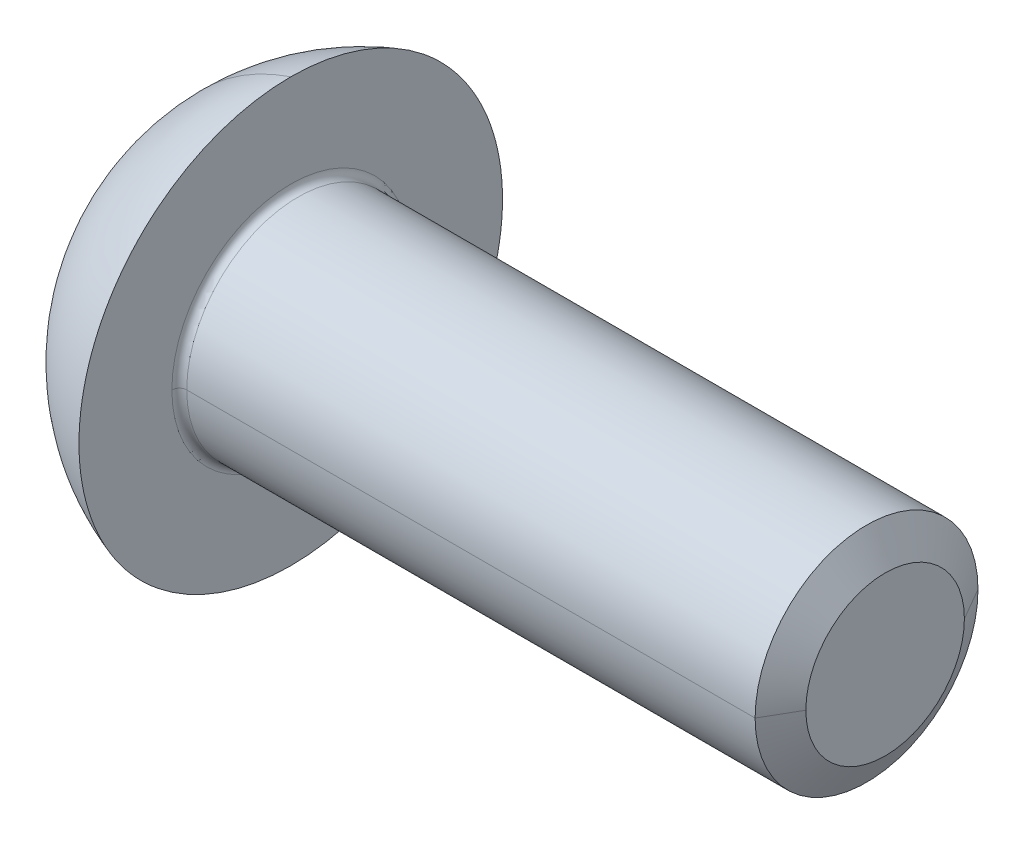
ISO-10303-21;
HEADER;
FILE_DESCRIPTION(('STEP AP214'),'2;1');
FILE_NAME('part.step','',(''),(''),'','','');
FILE_SCHEMA(('AUTOMOTIVE_DESIGN { 1 0 10303 214 1 1 1 1 }'));
ENDSEC;
DATA;
#1=APPLICATION_CONTEXT('core data for automotive mechanical design processes');
#2=APPLICATION_PROTOCOL_DEFINITION('international standard','automotive_design',2000,#1);
#3=PRODUCT_CONTEXT('',#1,'mechanical');
#4=PRODUCT('Part','Part','',(#3));
#5=PRODUCT_RELATED_PRODUCT_CATEGORY('part','',(#4));
#6=PRODUCT_DEFINITION_FORMATION('','',#4);
#7=PRODUCT_DEFINITION_CONTEXT('part definition',#1,'design');
#8=PRODUCT_DEFINITION('design','',#6,#7);
#9=PRODUCT_DEFINITION_SHAPE('','',#8);
#10=(LENGTH_UNIT() NAMED_UNIT(*) SI_UNIT(.MILLI.,.METRE.));
#11=(NAMED_UNIT(*) PLANE_ANGLE_UNIT() SI_UNIT($,.RADIAN.));
#12=(NAMED_UNIT(*) SI_UNIT($,.STERADIAN.) SOLID_ANGLE_UNIT());
#13=UNCERTAINTY_MEASURE_WITH_UNIT(LENGTH_MEASURE(1.E-05),#10,'distance_accuracy_value','');
#14=(GEOMETRIC_REPRESENTATION_CONTEXT(3) GLOBAL_UNCERTAINTY_ASSIGNED_CONTEXT((#13)) GLOBAL_UNIT_ASSIGNED_CONTEXT((#10,
#11,#12)) REPRESENTATION_CONTEXT('',''));
#15=CARTESIAN_POINT('',(0.,0.,0.));
#16=DIRECTION('',(0.,0.,1.));
#17=DIRECTION('',(1.,0.,0.));
#18=AXIS2_PLACEMENT_3D('',#15,#16,#17);
#19=CARTESIAN_POINT('',(0.,1.5,0.));
#20=DIRECTION('',(-1.,0.,0.));
#21=DIRECTION('',(0.,0.,1.));
#22=AXIS2_PLACEMENT_3D('',#19,#20,#21);
#23=PLANE('',#22);
#24=CARTESIAN_POINT('',(0.,0.,0.));
#25=DIRECTION('',(-1.,0.,0.));
#26=DIRECTION('',(0.,0.,1.));
#27=AXIS2_PLACEMENT_3D('',#24,#25,#26);
#28=CIRCLE('',#27,1.06698729810778);
#29=CARTESIAN_POINT('',(0.,0.,1.06698729810778));
#30=VERTEX_POINT('',#29);
#31=CARTESIAN_POINT('',(0.,0.,-1.06698729810778));
#32=VERTEX_POINT('',#31);
#33=EDGE_CURVE('E431',#30,#32,#28,.T.);
#34=ORIENTED_EDGE('',*,*,#33,.F.);
#35=CARTESIAN_POINT('',(0.,0.,0.));
#36=DIRECTION('',(-1.,0.,0.));
#37=DIRECTION('',(0.,0.,1.));
#38=AXIS2_PLACEMENT_3D('',#35,#36,#37);
#39=CIRCLE('',#38,1.06698729810778);
#40=EDGE_CURVE('E11',#32,#30,#39,.T.);
#41=ORIENTED_EDGE('',*,*,#40,.F.);
#42=EDGE_LOOP('',(#34,#41));
#43=FACE_BOUND('',#42,.T.);
#44=ADVANCED_FACE('F16',(#43),#23,.F.);
#45=CARTESIAN_POINT('',(-0.25,0.,0.));
#46=DIRECTION('',(-1.,0.,0.));
#47=DIRECTION('',(0.,0.,1.));
#48=AXIS2_PLACEMENT_3D('',#45,#46,#47);
#49=CONICAL_SURFACE('',#48,1.5,1.0471975511966);
#50=DIRECTION('',(-0.5,0.,-0.866025403784439));
#51=VECTOR('',#50,1.);
#52=CARTESIAN_POINT('',(-0.25,0.,-1.5));
#53=LINE('',#52,#51);
#54=CARTESIAN_POINT('',(-0.25,0.,-1.5));
#55=VERTEX_POINT('',#54);
#56=EDGE_CURVE('E439',#32,#55,#53,.T.);
#57=ORIENTED_EDGE('',*,*,#56,.F.);
#58=ORIENTED_EDGE('',*,*,#40,.T.);
#59=DIRECTION('',(-0.5,0.,0.866025403784439));
#60=VECTOR('',#59,1.);
#61=CARTESIAN_POINT('',(-0.25,0.,1.5));
#62=LINE('',#61,#60);
#63=CARTESIAN_POINT('',(-0.25,0.,1.5));
#64=VERTEX_POINT('',#63);
#65=EDGE_CURVE('E159',#30,#64,#62,.T.);
#66=ORIENTED_EDGE('',*,*,#65,.T.);
#67=CARTESIAN_POINT('',(-0.25,0.,0.));
#68=DIRECTION('',(-1.,0.,0.));
#69=DIRECTION('',(0.,0.,1.));
#70=AXIS2_PLACEMENT_3D('',#67,#68,#69);
#71=CIRCLE('',#70,1.5);
#72=EDGE_CURVE('E487',#55,#64,#71,.T.);
#73=ORIENTED_EDGE('',*,*,#72,.F.);
#74=EDGE_LOOP('',(#57,#58,#66,#73));
#75=FACE_BOUND('',#74,.T.);
#76=ADVANCED_FACE('F421',(#75),#49,.T.);
#77=CARTESIAN_POINT('',(-8.,0.577350269189628,1.));
#78=DIRECTION('',(0.,0.866025403784439,0.5));
#79=DIRECTION('',(1.,0.,0.));
#80=AXIS2_PLACEMENT_3D('',#77,#78,#79);
#81=PLANE('',#80);
#82=CARTESIAN_POINT('',(-9.65000000000068,1.15470053837921,0.));
#83=CARTESIAN_POINT('',(-9.64376726167592,1.13071986950292,0.0415357368933016));
#84=CARTESIAN_POINT('',(-9.63810980149159,1.10669828377802,0.0831423438471911));
#85=CARTESIAN_POINT('',(-9.62817117559528,1.05857535015065,0.166493709899067));
#86=CARTESIAN_POINT('',(-9.62389053369627,1.03447397540707,0.208238515487194));
#87=CARTESIAN_POINT('',(-9.6169532436391,0.986328910806296,0.291628213509428));
#88=CARTESIAN_POINT('',(-9.614288813427,0.96228550881187,0.333272607350576));
#89=CARTESIAN_POINT('',(-9.61071616129143,0.914169868462047,0.41661134107518));
#90=CARTESIAN_POINT('',(-9.60980762113605,0.890097636123247,0.458305670537585));
#91=CARTESIAN_POINT('',(-9.60980762113606,0.841953171445647,0.541694329462394));
#92=CARTESIAN_POINT('',(-9.61071616129145,0.817880939106848,0.583388658924797));
#93=CARTESIAN_POINT('',(-9.61428881342703,0.769765298757027,0.666727392649398));
#94=CARTESIAN_POINT('',(-9.61695324363914,0.745721896762602,0.708371786490545));
#95=CARTESIAN_POINT('',(-9.6238905336963,0.697576832161825,0.791761484512776));
#96=CARTESIAN_POINT('',(-9.62817117559529,0.673475457418251,0.833506290100903));
#97=CARTESIAN_POINT('',(-9.63810980149154,0.625352523790876,0.916857656152781));
#98=CARTESIAN_POINT('',(-9.64376726167582,0.60133093806598,0.958464263106673));
#99=CARTESIAN_POINT('',(-9.65000000000052,0.577350269189683,0.999999999999905));
#100=B_SPLINE_CURVE_WITH_KNOTS('',3,(#82,#83,#84,#85,#86,#87,#88,#89,#90,#91,#92,#93,#94,#95,
#96,#97,#98,#99),.UNSPECIFIED.,.F.,.F.,(4,2,2,2,2,2,2,2,4),(0.,0.145100985590908,
0.290257109991389,0.4347086423557,0.579133992329352,0.723559342302999,0.868010874667305,
1.01316699906778,1.15826798465868),.UNSPECIFIED.);
#101=CARTESIAN_POINT('',(-9.65000000046937,1.15470053837925,0.));
#102=VERTEX_POINT('',#101);
#103=CARTESIAN_POINT('',(-9.65000000046937,0.577350269189629,1.));
#104=VERTEX_POINT('',#103);
#105=EDGE_CURVE('E291',#102,#104,#100,.T.);
#106=ORIENTED_EDGE('',*,*,#105,.F.);
#107=DIRECTION('',(-1.,0.,0.));
#108=VECTOR('',#107,1.);
#109=CARTESIAN_POINT('',(-8.,1.15470053837925,0.));
#110=LINE('',#109,#108);
#111=CARTESIAN_POINT('',(-8.61,1.15470053837925,0.));
#112=VERTEX_POINT('',#111);
#113=EDGE_CURVE('E132',#112,#102,#110,.T.);
#114=ORIENTED_EDGE('',*,*,#113,.F.);
#115=CARTESIAN_POINT('',(-8.61,0.577350269189628,1.));
#116=CARTESIAN_POINT('',(-8.59669118616951,0.602534842869977,0.956379038818674));
#117=CARTESIAN_POINT('',(-8.58459776882803,0.627901365980377,0.912442931980091));
#118=CARTESIAN_POINT('',(-8.56347623600002,0.678999571015597,0.823938244683518));
#119=CARTESIAN_POINT('',(-8.55445410606408,0.704731865309021,0.779368603571993));
#120=CARTESIAN_POINT('',(-8.5403140378043,0.755930086890535,0.690690682535642));
#121=CARTESIAN_POINT('',(-8.53511923495459,0.78139052146778,0.64659191626507));
#122=CARTESIAN_POINT('',(-8.52879231643342,0.832415969093251,0.558213248498809));
#123=CARTESIAN_POINT('',(-8.52765622218832,0.857980855121199,0.513933567008696));
#124=CARTESIAN_POINT('',(-8.5294362546147,0.906212543236443,0.430393832658278));
#125=CARTESIAN_POINT('',(-8.53191348011681,0.928883762571843,0.391126128899826));
#126=CARTESIAN_POINT('',(-8.53996223171689,0.974103682037768,0.312802930870671));
#127=CARTESIAN_POINT('',(-8.54553612441605,0.996652275126995,0.273747622000933));
#128=CARTESIAN_POINT('',(-8.55954577375543,1.04195475948945,0.195281417376069));
#129=CARTESIAN_POINT('',(-8.56803338874673,1.06470453465151,0.155877650934607));
#130=CARTESIAN_POINT('',(-8.58736571836096,1.10991568547614,0.077569640637688));
#131=CARTESIAN_POINT('',(-8.5982065869898,1.13237746911104,0.0386646901534197));
#132=CARTESIAN_POINT('',(-8.61,1.15470053837925,0.));
#133=B_SPLINE_CURVE_WITH_KNOTS('',3,(#115,#116,#117,#118,#119,#120,#121,#122,#123,#124,#125,
#126,#127,#128,#129,#130,#131,#132),.UNSPECIFIED.,.F.,.F.,(4,2,2,2,2,2,2,2,4),(0.,
0.156341003276327,0.312984974046569,0.466390245349056,0.619645098882076,0.755763510276886,
0.891986092379271,1.03077096081375,1.16933069408602),.UNSPECIFIED.);
#134=CARTESIAN_POINT('',(-8.61,0.577350269189628,1.));
#135=VERTEX_POINT('',#134);
#136=EDGE_CURVE('E235',#135,#112,#133,.T.);
#137=ORIENTED_EDGE('',*,*,#136,.F.);
#138=DIRECTION('',(-1.,0.,0.));
#139=VECTOR('',#138,1.);
#140=CARTESIAN_POINT('',(-8.,0.577350269189628,1.));
#141=LINE('',#140,#139);
#142=EDGE_CURVE('E34',#135,#104,#141,.T.);
#143=ORIENTED_EDGE('',*,*,#142,.T.);
#144=EDGE_LOOP('',(#106,#114,#137,#143));
#145=FACE_BOUND('',#144,.T.);
#146=ADVANCED_FACE('F265',(#145),#81,.F.);
#147=CARTESIAN_POINT('',(-8.,-0.577350269189627,1.));
#148=DIRECTION('',(0.,0.,1.));
#149=DIRECTION('',(1.,0.,0.));
#150=AXIS2_PLACEMENT_3D('',#147,#148,#149);
#151=PLANE('',#150);
#152=CARTESIAN_POINT('',(-9.65000000000068,0.577350269189541,1.));
#153=CARTESIAN_POINT('',(-9.64377973065235,0.529473275543324,1.));
#154=CARTESIAN_POINT('',(-9.63813050190451,0.481515119884375,1.));
#155=CARTESIAN_POINT('',(-9.62821028183204,0.38550945440147,1.));
#156=CARTESIAN_POINT('',(-9.62393782154085,0.337462095195001,1.));
#157=CARTESIAN_POINT('',(-9.61699222106548,0.241237732564266,1.));
#158=CARTESIAN_POINT('',(-9.61431943549371,0.193060702770735,1.));
#159=CARTESIAN_POINT('',(-9.61071685569576,0.0965907516284085,1.));
#160=CARTESIAN_POINT('',(-9.60978892949644,0.0482977614337777,1.));
#161=CARTESIAN_POINT('',(-9.6098076211361,0.,1.));
#162=B_SPLINE_CURVE_WITH_KNOTS('',3,(#152,#153,#154,#155,#156,#157,#158,#159,#160,#161),
.UNSPECIFIED.,.F.,.F.,(4,2,2,2,4),(0.,0.144845042796863,0.289535025028086,0.434257069952768,
0.579133964656165),.UNSPECIFIED.);
#163=CARTESIAN_POINT('',(-9.60980762113568,0.,1.));
#164=VERTEX_POINT('',#163);
#165=EDGE_CURVE('E196',#104,#164,#162,.T.);
#166=ORIENTED_EDGE('',*,*,#165,.F.);
#167=ORIENTED_EDGE('',*,*,#142,.F.);
#168=CARTESIAN_POINT('',(-8.52827549630851,1.4285582721271E-13,1.));
#169=CARTESIAN_POINT('',(-8.52822782798261,0.0488748267229894,1.));
#170=CARTESIAN_POINT('',(-8.53016863705377,0.0977245826684721,1.));
#171=CARTESIAN_POINT('',(-8.53763474391835,0.194944280558686,1.));
#172=CARTESIAN_POINT('',(-8.54314472651941,0.243315380182376,1.));
#173=CARTESIAN_POINT('',(-8.55735616838471,0.339523836155668,1.));
#174=CARTESIAN_POINT('',(-8.56605465786892,0.387361646626337,1.));
#175=CARTESIAN_POINT('',(-8.58614159314306,0.482688461520486,1.));
#176=CARTESIAN_POINT('',(-8.59754141196548,0.530175091125679,1.));
#177=CARTESIAN_POINT('',(-8.61,0.577350269189628,1.));
#178=B_SPLINE_CURVE_WITH_KNOTS('',3,(#168,#169,#170,#171,#172,#173,#174,#175,#176,#177),
.UNSPECIFIED.,.F.,.F.,(4,2,2,2,4),(0.,0.146546606087911,0.292468514667007,0.438254855280999,
0.58466624068123),.UNSPECIFIED.);
#179=CARTESIAN_POINT('',(-8.52827549630851,1.4285582721271E-13,1.));
#180=VERTEX_POINT('',#179);
#181=EDGE_CURVE('E243',#180,#135,#178,.T.);
#182=ORIENTED_EDGE('',*,*,#181,.F.);
#183=CARTESIAN_POINT('',(-8.61,-0.577350269189627,1.));
#184=CARTESIAN_POINT('',(-8.59754141196548,-0.530175091125654,1.));
#185=CARTESIAN_POINT('',(-8.58614159314305,-0.482688461520439,1.));
#186=CARTESIAN_POINT('',(-8.5660546578689,-0.387361646626243,1.));
#187=CARTESIAN_POINT('',(-8.55735616838469,-0.33952383615555,1.));
#188=CARTESIAN_POINT('',(-8.54314472651938,-0.243315380182211,1.));
#189=CARTESIAN_POINT('',(-8.53763474391832,-0.194944280558497,1.));
#190=CARTESIAN_POINT('',(-8.53016863705376,-0.0977245826682346,1.));
#191=CARTESIAN_POINT('',(-8.52822782798261,-0.0488748267227278,1.));
#192=CARTESIAN_POINT('',(-8.52827549630851,1.42752632317457E-13,1.));
#193=B_SPLINE_CURVE_WITH_KNOTS('',3,(#183,#184,#185,#186,#187,#188,#189,#190,#191,#192),
.UNSPECIFIED.,.F.,.F.,(4,2,2,2,4),(0.,0.146411385400302,0.292197726014365,0.438119634593531,
0.584666240681514),.UNSPECIFIED.);
#194=CARTESIAN_POINT('',(-8.61,-0.577350269189627,1.));
#195=VERTEX_POINT('',#194);
#196=EDGE_CURVE('E327',#195,#180,#193,.T.);
#197=ORIENTED_EDGE('',*,*,#196,.F.);
#198=DIRECTION('',(-1.,0.,0.));
#199=VECTOR('',#198,1.);
#200=CARTESIAN_POINT('',(-8.,-0.577350269189627,1.));
#201=LINE('',#200,#199);
#202=CARTESIAN_POINT('',(-9.65000000046937,-0.57735026918963,1.));
#203=VERTEX_POINT('',#202);
#204=EDGE_CURVE('E166',#195,#203,#201,.T.);
#205=ORIENTED_EDGE('',*,*,#204,.T.);
#206=CARTESIAN_POINT('',(-9.60980762113613,0.,1.));
#207=CARTESIAN_POINT('',(-9.60978892949634,-0.0482977614337789,1.));
#208=CARTESIAN_POINT('',(-9.61071685569565,-0.0965907516284106,1.));
#209=CARTESIAN_POINT('',(-9.61431943549365,-0.193060702770737,1.));
#210=CARTESIAN_POINT('',(-9.61699222106547,-0.241237732564265,1.));
#211=CARTESIAN_POINT('',(-9.62393782154089,-0.337462095195,1.));
#212=CARTESIAN_POINT('',(-9.62821028183206,-0.385509454401471,1.));
#213=CARTESIAN_POINT('',(-9.6381305019045,-0.481515119884378,1.));
#214=CARTESIAN_POINT('',(-9.64377973065232,-0.529473275543328,1.));
#215=CARTESIAN_POINT('',(-9.65000000000067,-0.577350269189545,1.));
#216=B_SPLINE_CURVE_WITH_KNOTS('',3,(#206,#207,#208,#209,#210,#211,#212,#213,#214,#215),
.UNSPECIFIED.,.F.,.F.,(4,2,2,2,4),(0.,0.144876894703401,0.289598939628086,0.434288921859311,
0.579133964656175),.UNSPECIFIED.);
#217=EDGE_CURVE('E281',#164,#203,#216,.T.);
#218=ORIENTED_EDGE('',*,*,#217,.F.);
#219=EDGE_LOOP('',(#166,#167,#182,#197,#205,#218));
#220=FACE_BOUND('',#219,.T.);
#221=ADVANCED_FACE('F260',(#220),#151,.F.);
#222=CARTESIAN_POINT('',(-8.,-1.15470053837925,0.));
#223=DIRECTION('',(0.,-0.866025403784439,0.5));
#224=DIRECTION('',(-1.,0.,0.));
#225=AXIS2_PLACEMENT_3D('',#222,#223,#224);
#226=PLANE('',#225);
#227=CARTESIAN_POINT('',(-9.65000000000068,-0.577350269189672,0.999999999999921));
#228=CARTESIAN_POINT('',(-9.64376726167592,-0.601330938065965,0.958464263106695));
#229=CARTESIAN_POINT('',(-9.63810980149159,-0.62535252379086,0.916857656152805));
#230=CARTESIAN_POINT('',(-9.62817117559528,-0.673475457418234,0.833506290100929));
#231=CARTESIAN_POINT('',(-9.62389053369627,-0.697576832161807,0.791761484512803));
#232=CARTESIAN_POINT('',(-9.6169532436391,-0.745721896762585,0.70837178649057));
#233=CARTESIAN_POINT('',(-9.614288813427,-0.769765298757011,0.666727392649422));
#234=CARTESIAN_POINT('',(-9.61071616129143,-0.817880939106833,0.583388658924818));
#235=CARTESIAN_POINT('',(-9.60980762113605,-0.841953171445634,0.541694329462413));
#236=CARTESIAN_POINT('',(-9.60980762113606,-0.890097636123234,0.458305670537605));
#237=CARTESIAN_POINT('',(-9.61071616129145,-0.914169868462033,0.416611341075201));
#238=CARTESIAN_POINT('',(-9.61428881342703,-0.962285508811854,0.333272607350601));
#239=CARTESIAN_POINT('',(-9.61695324363914,-0.986328910806278,0.291628213509455));
#240=CARTESIAN_POINT('',(-9.6238905336963,-1.03447397540706,0.208238515487223));
#241=CARTESIAN_POINT('',(-9.62817117559529,-1.05857535015063,0.166493709899097));
#242=CARTESIAN_POINT('',(-9.63810980149154,-1.106698283778,0.0831423438472185));
#243=CARTESIAN_POINT('',(-9.64376726167582,-1.1307198695029,0.0415357368933265));
#244=CARTESIAN_POINT('',(-9.65000000000052,-1.1547005383792,0.));
#245=B_SPLINE_CURVE_WITH_KNOTS('',3,(#227,#228,#229,#230,#231,#232,#233,#234,#235,#236,#237,
#238,#239,#240,#241,#242,#243,#244),.UNSPECIFIED.,.F.,.F.,(4,2,2,2,2,2,2,2,4),(0.,
0.145100985590907,0.290257109991388,0.434708642355698,0.57913399232935,0.723559342302996,
0.868010874667301,1.01316699906778,1.15826798465868),.UNSPECIFIED.);
#246=CARTESIAN_POINT('',(-9.65000000046937,-1.15470053837925,0.));
#247=VERTEX_POINT('',#246);
#248=EDGE_CURVE('E290',#203,#247,#245,.T.);
#249=ORIENTED_EDGE('',*,*,#248,.F.);
#250=ORIENTED_EDGE('',*,*,#204,.F.);
#251=CARTESIAN_POINT('',(-8.61,-1.15470053837925,0.));
#252=CARTESIAN_POINT('',(-8.59669118616951,-1.1295159646989,0.0436209611813256));
#253=CARTESIAN_POINT('',(-8.58459776882803,-1.1041494415885,0.0875570680199079));
#254=CARTESIAN_POINT('',(-8.56347623600002,-1.05305123655328,0.176061755316481));
#255=CARTESIAN_POINT('',(-8.55445410606407,-1.02731894225986,0.220631396428006));
#256=CARTESIAN_POINT('',(-8.5403140378043,-0.976120720678346,0.309309317464357));
#257=CARTESIAN_POINT('',(-8.53511923495459,-0.950660286101101,0.353408083734928));
#258=CARTESIAN_POINT('',(-8.52879231643342,-0.89963483847563,0.441786751501189));
#259=CARTESIAN_POINT('',(-8.52765622218832,-0.874069952447682,0.486066432991302));
#260=CARTESIAN_POINT('',(-8.52943625461469,-0.825838264332438,0.56960616734172));
#261=CARTESIAN_POINT('',(-8.53191348011681,-0.803167044997038,0.608873871100172));
#262=CARTESIAN_POINT('',(-8.53996223171689,-0.757947125531113,0.687197069129327));
#263=CARTESIAN_POINT('',(-8.54553612441605,-0.735398532441885,0.726252377999065));
#264=CARTESIAN_POINT('',(-8.55954577375543,-0.690096048079432,0.804718582623929));
#265=CARTESIAN_POINT('',(-8.56803338874673,-0.667346272917369,0.844122349065392));
#266=CARTESIAN_POINT('',(-8.58736571836095,-0.622135122092738,0.922430359362311));
#267=CARTESIAN_POINT('',(-8.59820658698979,-0.599673338457837,0.96133530984658));
#268=CARTESIAN_POINT('',(-8.61,-0.577350269189626,1.));
#269=B_SPLINE_CURVE_WITH_KNOTS('',3,(#251,#252,#253,#254,#255,#256,#257,#258,#259,#260,#261,
#262,#263,#264,#265,#266,#267,#268),.UNSPECIFIED.,.F.,.F.,(4,2,2,2,2,2,2,2,4),(0.,
0.156341003276326,0.312984974046568,0.466390245349054,0.619645098882075,0.755763510276885,
0.891986092379271,1.03077096081375,1.16933069408602),.UNSPECIFIED.);
#270=CARTESIAN_POINT('',(-8.61,-1.15470053837925,0.));
#271=VERTEX_POINT('',#270);
#272=EDGE_CURVE('E141',#271,#195,#269,.T.);
#273=ORIENTED_EDGE('',*,*,#272,.F.);
#274=DIRECTION('',(-1.,0.,0.));
#275=VECTOR('',#274,1.);
#276=CARTESIAN_POINT('',(-8.,-1.15470053837925,0.));
#277=LINE('',#276,#275);
#278=EDGE_CURVE('E131',#271,#247,#277,.T.);
#279=ORIENTED_EDGE('',*,*,#278,.T.);
#280=EDGE_LOOP('',(#249,#250,#273,#279));
#281=FACE_BOUND('',#280,.T.);
#282=ADVANCED_FACE('F18',(#281),#226,.F.);
#283=CARTESIAN_POINT('',(-8.,-0.577350269189626,-1.));
#284=DIRECTION('',(0.,-0.866025403784439,-0.5));
#285=DIRECTION('',(0.,0.5,-0.866025403784439));
#286=AXIS2_PLACEMENT_3D('',#283,#284,#285);
#287=PLANE('',#286);
#288=CARTESIAN_POINT('',(-9.65000000000068,-1.15470053837921,0.));
#289=CARTESIAN_POINT('',(-9.64376726167592,-1.13071986950292,-0.0415357368932996));
#290=CARTESIAN_POINT('',(-9.63810980149159,-1.10669828377802,-0.0831423438471893));
#291=CARTESIAN_POINT('',(-9.62817117559528,-1.05857535015065,-0.166493709899066));
#292=CARTESIAN_POINT('',(-9.62389053369627,-1.03447397540707,-0.208238515487192));
#293=CARTESIAN_POINT('',(-9.6169532436391,-0.986328910806295,-0.291628213509426));
#294=CARTESIAN_POINT('',(-9.614288813427,-0.962285508811869,-0.333272607350574));
#295=CARTESIAN_POINT('',(-9.61071616129143,-0.914169868462046,-0.416611341075179));
#296=CARTESIAN_POINT('',(-9.60980762113605,-0.890097636123246,-0.458305670537584));
#297=CARTESIAN_POINT('',(-9.60980762113606,-0.841953171445645,-0.541694329462393));
#298=CARTESIAN_POINT('',(-9.61071616129145,-0.817880939106846,-0.583388658924796));
#299=CARTESIAN_POINT('',(-9.61428881342703,-0.769765298757025,-0.666727392649397));
#300=CARTESIAN_POINT('',(-9.61695324363914,-0.7457218967626,-0.708371786490544));
#301=CARTESIAN_POINT('',(-9.6238905336963,-0.697576832161823,-0.791761484512776));
#302=CARTESIAN_POINT('',(-9.62817117559529,-0.67347545741825,-0.833506290100902));
#303=CARTESIAN_POINT('',(-9.63810980149154,-0.625352523790874,-0.916857656152781));
#304=CARTESIAN_POINT('',(-9.64376726167582,-0.601330938065978,-0.958464263106673));
#305=CARTESIAN_POINT('',(-9.65000000000052,-0.577350269189681,-0.999999999999905));
#306=B_SPLINE_CURVE_WITH_KNOTS('',3,(#288,#289,#290,#291,#292,#293,#294,#295,#296,#297,#298,
#299,#300,#301,#302,#303,#304,#305),.UNSPECIFIED.,.F.,.F.,(4,2,2,2,2,2,2,2,4),(0.,
0.145100985590908,0.29025710999139,0.4347086423557,0.579133992329353,0.723559342303001,
0.868010874667307,1.01316699906778,1.15826798465869),.UNSPECIFIED.);
#307=CARTESIAN_POINT('',(-9.65000000046937,-0.577350269189626,-1.));
#308=VERTEX_POINT('',#307);
#309=EDGE_CURVE('E252',#247,#308,#306,.T.);
#310=ORIENTED_EDGE('',*,*,#309,.F.);
#311=ORIENTED_EDGE('',*,*,#278,.F.);
#312=CARTESIAN_POINT('',(-8.61,-0.577350269189626,-1.));
#313=CARTESIAN_POINT('',(-8.59669118616951,-0.602534842869975,-0.956379038818673));
#314=CARTESIAN_POINT('',(-8.58459776882803,-0.627901365980375,-0.912442931980091));
#315=CARTESIAN_POINT('',(-8.56347623600002,-0.678999571015595,-0.823938244683518));
#316=CARTESIAN_POINT('',(-8.55445410606407,-0.704731865309019,-0.779368603571993));
#317=CARTESIAN_POINT('',(-8.5403140378043,-0.755930086890532,-0.690690682535642));
#318=CARTESIAN_POINT('',(-8.53511923495459,-0.781390521467777,-0.646591916265071));
#319=CARTESIAN_POINT('',(-8.52879231643342,-0.832415969093248,-0.55821324849881));
#320=CARTESIAN_POINT('',(-8.52765622218832,-0.857980855121196,-0.513933567008697));
#321=CARTESIAN_POINT('',(-8.52943625461469,-0.90621254323644,-0.430393832658279));
#322=CARTESIAN_POINT('',(-8.53191348011681,-0.92888376257184,-0.391126128899827));
#323=CARTESIAN_POINT('',(-8.53996223171689,-0.974103682037765,-0.312802930870672));
#324=CARTESIAN_POINT('',(-8.54553612441605,-0.996652275126992,-0.273747622000934));
#325=CARTESIAN_POINT('',(-8.55954577375543,-1.04195475948945,-0.19528141737607));
#326=CARTESIAN_POINT('',(-8.56803338874673,-1.06470453465151,-0.155877650934608));
#327=CARTESIAN_POINT('',(-8.58736571836095,-1.10991568547614,-0.0775696406376888));
#328=CARTESIAN_POINT('',(-8.59820658698979,-1.13237746911104,-0.0386646901534204));
#329=CARTESIAN_POINT('',(-8.61,-1.15470053837925,0.));
#330=B_SPLINE_CURVE_WITH_KNOTS('',3,(#312,#313,#314,#315,#316,#317,#318,#319,#320,#321,#322,
#323,#324,#325,#326,#327,#328,#329),.UNSPECIFIED.,.F.,.F.,(4,2,2,2,2,2,2,2,4),(0.,
0.156341003276326,0.312984974046568,0.466390245349054,0.619645098882075,0.755763510276884,
0.89198609237927,1.03077096081375,1.16933069408602),.UNSPECIFIED.);
#331=CARTESIAN_POINT('',(-8.61,-0.577350269189626,-1.));
#332=VERTEX_POINT('',#331);
#333=EDGE_CURVE('E135',#332,#271,#330,.T.);
#334=ORIENTED_EDGE('',*,*,#333,.F.);
#335=DIRECTION('',(-1.,0.,0.));
#336=VECTOR('',#335,1.);
#337=CARTESIAN_POINT('',(-8.,-0.577350269189626,-1.));
#338=LINE('',#337,#336);
#339=EDGE_CURVE('E119',#332,#308,#338,.T.);
#340=ORIENTED_EDGE('',*,*,#339,.T.);
#341=EDGE_LOOP('',(#310,#311,#334,#340));
#342=FACE_BOUND('',#341,.T.);
#343=ADVANCED_FACE('F136',(#342),#287,.F.);
#344=CARTESIAN_POINT('',(-8.,0.577350269189628,-1.));
#345=DIRECTION('',(0.,0.,-1.));
#346=DIRECTION('',(0.,-1.,0.));
#347=AXIS2_PLACEMENT_3D('',#344,#345,#346);
#348=PLANE('',#347);
#349=CARTESIAN_POINT('',(-9.65000000000068,-0.577350269189539,-1.));
#350=CARTESIAN_POINT('',(-9.64376726167592,-0.529388931436952,-1.));
#351=CARTESIAN_POINT('',(-9.63810980149159,-0.481345759987161,-1.));
#352=CARTESIAN_POINT('',(-9.62817117559528,-0.385099892732414,-1.));
#353=CARTESIAN_POINT('',(-9.62389053369627,-0.336897143245266,-1.));
#354=CARTESIAN_POINT('',(-9.6169532436391,-0.24060701404371,-1.));
#355=CARTESIAN_POINT('',(-9.614288813427,-0.192520210054858,-1.));
#356=CARTESIAN_POINT('',(-9.61071616129143,-0.0962889293552123,-1.));
#357=CARTESIAN_POINT('',(-9.60980762113605,-0.0481444646776111,-1.));
#358=CARTESIAN_POINT('',(-9.60980762113606,0.0481444646775891,-1.));
#359=CARTESIAN_POINT('',(-9.61071616129145,0.0962889293551882,-1.));
#360=CARTESIAN_POINT('',(-9.61428881342703,0.19252021005483,-1.));
#361=CARTESIAN_POINT('',(-9.61695324363914,0.24060701404368,-1.));
#362=CARTESIAN_POINT('',(-9.6238905336963,0.336897143245234,-1.));
#363=CARTESIAN_POINT('',(-9.62817117559529,0.385099892732381,-1.));
#364=CARTESIAN_POINT('',(-9.63810980149154,0.481345759987132,-1.));
#365=CARTESIAN_POINT('',(-9.64376726167582,0.529388931436925,-1.));
#366=CARTESIAN_POINT('',(-9.65000000000052,0.577350269189519,-1.));
#367=B_SPLINE_CURVE_WITH_KNOTS('',3,(#349,#350,#351,#352,#353,#354,#355,#356,#357,#358,#359,
#360,#361,#362,#363,#364,#365,#366),.UNSPECIFIED.,.F.,.F.,(4,2,2,2,2,2,2,2,4),(0.,
0.145100985590908,0.29025710999139,0.434708642355701,0.579133992329354,0.723559342303001,
0.868010874667307,1.01316699906779,1.15826798465869),.UNSPECIFIED.);
#368=CARTESIAN_POINT('',(-9.65000000046937,0.577350269189629,-1.));
#369=VERTEX_POINT('',#368);
#370=EDGE_CURVE('E125',#308,#369,#367,.T.);
#371=ORIENTED_EDGE('',*,*,#370,.F.);
#372=ORIENTED_EDGE('',*,*,#339,.F.);
#373=CARTESIAN_POINT('',(-8.52827549630851,1.42978290888809E-13,-1.));
#374=CARTESIAN_POINT('',(-8.52822782798261,-0.0488748267227276,-1.));
#375=CARTESIAN_POINT('',(-8.53016863705376,-0.0977245826682343,-1.));
#376=CARTESIAN_POINT('',(-8.53763474391832,-0.194944280558496,-1.));
#377=CARTESIAN_POINT('',(-8.54314472651938,-0.24331538018221,-1.));
#378=CARTESIAN_POINT('',(-8.55735616838469,-0.339523836155549,-1.));
#379=CARTESIAN_POINT('',(-8.5660546578689,-0.387361646626242,-1.));
#380=CARTESIAN_POINT('',(-8.58614159314305,-0.482688461520438,-1.));
#381=CARTESIAN_POINT('',(-8.59754141196548,-0.530175091125654,-1.));
#382=CARTESIAN_POINT('',(-8.61,-0.577350269189626,-1.));
#383=B_SPLINE_CURVE_WITH_KNOTS('',3,(#373,#374,#375,#376,#377,#378,#379,#380,#381,#382),
.UNSPECIFIED.,.F.,.F.,(4,2,2,2,4),(0.,0.146546606087983,0.292468514667149,0.438254855281212,
0.584666240681513),.UNSPECIFIED.);
#384=CARTESIAN_POINT('',(-8.52827549630851,1.42978290888809E-13,-1.));
#385=VERTEX_POINT('',#384);
#386=EDGE_CURVE('E21',#385,#332,#383,.T.);
#387=ORIENTED_EDGE('',*,*,#386,.F.);
#388=CARTESIAN_POINT('',(-8.61,0.577350269189628,-1.));
#389=CARTESIAN_POINT('',(-8.59754141196548,0.530175091125679,-1.));
#390=CARTESIAN_POINT('',(-8.58614159314306,0.482688461520486,-1.));
#391=CARTESIAN_POINT('',(-8.56605465786892,0.387361646626337,-1.));
#392=CARTESIAN_POINT('',(-8.55735616838471,0.339523836155668,-1.));
#393=CARTESIAN_POINT('',(-8.54314472651941,0.243315380182376,-1.));
#394=CARTESIAN_POINT('',(-8.53763474391835,0.194944280558686,-1.));
#395=CARTESIAN_POINT('',(-8.53016863705377,0.0977245826684721,-1.));
#396=CARTESIAN_POINT('',(-8.52822782798261,0.0488748267229895,-1.));
#397=CARTESIAN_POINT('',(-8.52827549630851,1.42881253896957E-13,-1.));
#398=B_SPLINE_CURVE_WITH_KNOTS('',3,(#388,#389,#390,#391,#392,#393,#394,#395,#396,#397),
.UNSPECIFIED.,.F.,.F.,(4,2,2,2,4),(0.,0.146411385400231,0.292197726014223,0.438119634593318,
0.58466624068123),.UNSPECIFIED.);
#399=CARTESIAN_POINT('',(-8.61,0.577350269189628,-1.));
#400=VERTEX_POINT('',#399);
#401=EDGE_CURVE('E110',#400,#385,#398,.T.);
#402=ORIENTED_EDGE('',*,*,#401,.F.);
#403=DIRECTION('',(-1.,0.,0.));
#404=VECTOR('',#403,1.);
#405=CARTESIAN_POINT('',(-8.,0.577350269189628,-1.));
#406=LINE('',#405,#404);
#407=EDGE_CURVE('E49',#400,#369,#406,.T.);
#408=ORIENTED_EDGE('',*,*,#407,.T.);
#409=EDGE_LOOP('',(#371,#372,#387,#402,#408));
#410=FACE_BOUND('',#409,.T.);
#411=ADVANCED_FACE('F121',(#410),#348,.F.);
#412=CARTESIAN_POINT('',(-8.,1.15470053837925,0.));
#413=DIRECTION('',(0.,0.866025403784439,-0.5));
#414=DIRECTION('',(-1.,0.,0.));
#415=AXIS2_PLACEMENT_3D('',#412,#413,#414);
#416=PLANE('',#415);
#417=CARTESIAN_POINT('',(-9.65000000000068,0.577350269189673,-0.999999999999924));
#418=CARTESIAN_POINT('',(-9.64376726167592,0.601330938065966,-0.958464263106698));
#419=CARTESIAN_POINT('',(-9.63810980149159,0.625352523790861,-0.916857656152808));
#420=CARTESIAN_POINT('',(-9.62817117559528,0.673475457418235,-0.833506290100932));
#421=CARTESIAN_POINT('',(-9.62389053369627,0.697576832161808,-0.791761484512806));
#422=CARTESIAN_POINT('',(-9.6169532436391,0.745721896762586,-0.708371786490572));
#423=CARTESIAN_POINT('',(-9.614288813427,0.769765298757012,-0.666727392649424));
#424=CARTESIAN_POINT('',(-9.61071616129143,0.817880939106835,-0.58338865892482));
#425=CARTESIAN_POINT('',(-9.60980762113605,0.841953171445636,-0.541694329462415));
#426=CARTESIAN_POINT('',(-9.60980762113606,0.890097636123236,-0.458305670537606));
#427=CARTESIAN_POINT('',(-9.61071616129145,0.914169868462035,-0.416611341075203));
#428=CARTESIAN_POINT('',(-9.61428881342704,0.962285508811856,-0.333272607350602));
#429=CARTESIAN_POINT('',(-9.61695324363914,0.98632891080628,-0.291628213509456));
#430=CARTESIAN_POINT('',(-9.6238905336963,1.03447397540706,-0.208238515487224));
#431=CARTESIAN_POINT('',(-9.62817117559529,1.05857535015063,-0.166493709899097));
#432=CARTESIAN_POINT('',(-9.63810980149154,1.10669828377801,-0.0831423438472188));
#433=CARTESIAN_POINT('',(-9.64376726167582,1.1307198695029,-0.0415357368933266));
#434=CARTESIAN_POINT('',(-9.65000000000052,1.1547005383792,0.));
#435=B_SPLINE_CURVE_WITH_KNOTS('',3,(#417,#418,#419,#420,#421,#422,#423,#424,#425,#426,#427,
#428,#429,#430,#431,#432,#433,#434),.UNSPECIFIED.,.F.,.F.,(4,2,2,2,2,2,2,2,4),(0.,
0.145100985590907,0.290257109991389,0.434708642355699,0.579133992329351,0.723559342302999,
0.868010874667304,1.01316699906778,1.15826798465868),.UNSPECIFIED.);
#436=EDGE_CURVE('E373',#369,#102,#435,.T.);
#437=ORIENTED_EDGE('',*,*,#436,.F.);
#438=ORIENTED_EDGE('',*,*,#407,.F.);
#439=CARTESIAN_POINT('',(-8.61,1.15470053837925,0.));
#440=CARTESIAN_POINT('',(-8.59669118616951,1.1295159646989,-0.0436209611813278));
#441=CARTESIAN_POINT('',(-8.58459776882803,1.1041494415885,-0.0875570680199103));
#442=CARTESIAN_POINT('',(-8.56347623600002,1.05305123655328,-0.176061755316483));
#443=CARTESIAN_POINT('',(-8.55445410606408,1.02731894225986,-0.220631396428009));
#444=CARTESIAN_POINT('',(-8.5403140378043,0.976120720678347,-0.309309317464359));
#445=CARTESIAN_POINT('',(-8.53511923495459,0.950660286101102,-0.353408083734931));
#446=CARTESIAN_POINT('',(-8.52879231643343,0.899634838475631,-0.441786751501192));
#447=CARTESIAN_POINT('',(-8.52765622218832,0.874069952447683,-0.486066432991305));
#448=CARTESIAN_POINT('',(-8.52943625461469,0.82583826433244,-0.569606167341723));
#449=CARTESIAN_POINT('',(-8.53191348011681,0.803167044997039,-0.608873871100175));
#450=CARTESIAN_POINT('',(-8.53996223171689,0.757947125531114,-0.68719706912933));
#451=CARTESIAN_POINT('',(-8.54553612441605,0.735398532441887,-0.726252377999067));
#452=CARTESIAN_POINT('',(-8.55954577375543,0.690096048079434,-0.804718582623931));
#453=CARTESIAN_POINT('',(-8.56803338874673,0.667346272917371,-0.844122349065393));
#454=CARTESIAN_POINT('',(-8.58736571836095,0.622135122092741,-0.922430359362312));
#455=CARTESIAN_POINT('',(-8.59820658698979,0.599673338457839,-0.96133530984658));
#456=CARTESIAN_POINT('',(-8.61,0.577350269189629,-1.));
#457=B_SPLINE_CURVE_WITH_KNOTS('',3,(#439,#440,#441,#442,#443,#444,#445,#446,#447,#448,#449,
#450,#451,#452,#453,#454,#455,#456),.UNSPECIFIED.,.F.,.F.,(4,2,2,2,2,2,2,2,4),(0.,
0.156341003276326,0.312984974046569,0.466390245349055,0.619645098882076,0.755763510276885,
0.891986092379271,1.03077096081375,1.16933069408601),.UNSPECIFIED.);
#458=EDGE_CURVE('E213',#112,#400,#457,.T.);
#459=ORIENTED_EDGE('',*,*,#458,.F.);
#460=ORIENTED_EDGE('',*,*,#113,.T.);
#461=EDGE_LOOP('',(#437,#438,#459,#460));
#462=FACE_BOUND('',#461,.T.);
#463=ADVANCED_FACE('F228',(#462),#416,.F.);
#464=CARTESIAN_POINT('',(-8.61,0.,0.));
#465=DIRECTION('',(-1.,0.,0.));
#466=DIRECTION('',(0.,0.,1.));
#467=AXIS2_PLACEMENT_3D('',#464,#465,#466);
#468=CONICAL_SURFACE('',#467,1.15470053837925,1.08478502970568);
#469=DIRECTION('',(-0.467102790096399,0.,-0.884203021643875));
#470=VECTOR('',#469,1.);
#471=CARTESIAN_POINT('',(-8.61,0.,-1.15470053837925));
#472=LINE('',#471,#470);
#473=CARTESIAN_POINT('',(-8.,0.,0.));
#474=VERTEX_POINT('',#473);
#475=EDGE_CURVE('E144',#474,#385,#472,.T.);
#476=ORIENTED_EDGE('',*,*,#475,.F.);
#477=DIRECTION('',(-0.467102790096399,0.,0.884203021643875));
#478=VECTOR('',#477,1.);
#479=CARTESIAN_POINT('',(-8.61,0.,1.15470053837925));
#480=LINE('',#479,#478);
#481=EDGE_CURVE('E151',#474,#180,#480,.T.);
#482=ORIENTED_EDGE('',*,*,#481,.T.);
#483=ORIENTED_EDGE('',*,*,#181,.T.);
#484=ORIENTED_EDGE('',*,*,#136,.T.);
#485=ORIENTED_EDGE('',*,*,#458,.T.);
#486=ORIENTED_EDGE('',*,*,#401,.T.);
#487=EDGE_LOOP('',(#476,#482,#483,#484,#485,#486));
#488=FACE_BOUND('',#487,.T.);
#489=ADVANCED_FACE('F222',(#488),#468,.F.);
#490=CARTESIAN_POINT('',(-1009.35,0.,0.));
#491=DIRECTION('',(-1.,0.,0.));
#492=DIRECTION('',(0.,0.,1.));
#493=AXIS2_PLACEMENT_3D('',#490,#491,#492);
#494=CONICAL_SURFACE('',#493,3849.00179459751,1.31660847419538);
#495=ORIENTED_EDGE('',*,*,#309,.T.);
#496=CARTESIAN_POINT('',(-9.65,0.,0.));
#497=DIRECTION('',(-1.,0.,0.));
#498=DIRECTION('',(0.,0.,-1.));
#499=AXIS2_PLACEMENT_3D('',#496,#497,#498);
#500=CIRCLE('',#499,1.15470053837925);
#501=EDGE_CURVE('E176',#308,#247,#500,.T.);
#502=ORIENTED_EDGE('',*,*,#501,.T.);
#503=EDGE_LOOP('',(#495,#502));
#504=FACE_BOUND('',#503,.T.);
#505=ADVANCED_FACE('F227',(#504),#494,.F.);
#506=CARTESIAN_POINT('',(-1009.35,0.,0.));
#507=DIRECTION('',(-1.,0.,0.));
#508=DIRECTION('',(0.,0.,1.));
#509=AXIS2_PLACEMENT_3D('',#506,#507,#508);
#510=CONICAL_SURFACE('',#509,3849.00179459751,1.31660847419538);
#511=ORIENTED_EDGE('',*,*,#248,.T.);
#512=CARTESIAN_POINT('',(-9.65,0.,0.));
#513=DIRECTION('',(-1.,0.,0.));
#514=DIRECTION('',(0.,0.,-1.));
#515=AXIS2_PLACEMENT_3D('',#512,#513,#514);
#516=CIRCLE('',#515,1.15470053837925);
#517=EDGE_CURVE('E170',#247,#203,#516,.T.);
#518=ORIENTED_EDGE('',*,*,#517,.T.);
#519=EDGE_LOOP('',(#511,#518));
#520=FACE_BOUND('',#519,.T.);
#521=ADVANCED_FACE('F307',(#520),#510,.F.);
#522=CARTESIAN_POINT('',(-1009.35,0.,0.));
#523=DIRECTION('',(-1.,0.,0.));
#524=DIRECTION('',(0.,0.,1.));
#525=AXIS2_PLACEMENT_3D('',#522,#523,#524);
#526=CONICAL_SURFACE('',#525,3849.00179459751,1.31660847419538);
#527=DIRECTION('',(-0.2514594403022,0.,0.967867836991655));
#528=VECTOR('',#527,1.);
#529=CARTESIAN_POINT('',(-9.35,0.,0.));
#530=LINE('',#529,#528);
#531=CARTESIAN_POINT('',(-9.65,0.,1.15470053837925));
#532=VERTEX_POINT('',#531);
#533=EDGE_CURVE('E191',#164,#532,#530,.T.);
#534=ORIENTED_EDGE('',*,*,#533,.F.);
#535=ORIENTED_EDGE('',*,*,#217,.T.);
#536=CARTESIAN_POINT('',(-9.65,0.,0.));
#537=DIRECTION('',(-1.,0.,0.));
#538=DIRECTION('',(0.,0.,-1.));
#539=AXIS2_PLACEMENT_3D('',#536,#537,#538);
#540=CIRCLE('',#539,1.15470053837925);
#541=EDGE_CURVE('E175',#203,#532,#540,.T.);
#542=ORIENTED_EDGE('',*,*,#541,.T.);
#543=EDGE_LOOP('',(#534,#535,#542));
#544=FACE_BOUND('',#543,.T.);
#545=ADVANCED_FACE('F302',(#544),#526,.F.);
#546=CARTESIAN_POINT('',(-1009.35,0.,0.));
#547=DIRECTION('',(-1.,0.,0.));
#548=DIRECTION('',(0.,0.,1.));
#549=AXIS2_PLACEMENT_3D('',#546,#547,#548);
#550=CONICAL_SURFACE('',#549,3849.00179459751,1.31660847419538);
#551=ORIENTED_EDGE('',*,*,#105,.T.);
#552=CARTESIAN_POINT('',(-9.65,0.,0.));
#553=DIRECTION('',(-1.,0.,0.));
#554=DIRECTION('',(0.,0.,1.));
#555=AXIS2_PLACEMENT_3D('',#552,#553,#554);
#556=CIRCLE('',#555,1.15470053837925);
#557=EDGE_CURVE('E190',#104,#102,#556,.T.);
#558=ORIENTED_EDGE('',*,*,#557,.T.);
#559=EDGE_LOOP('',(#551,#558));
#560=FACE_BOUND('',#559,.T.);
#561=ADVANCED_FACE('F306',(#560),#550,.F.);
#562=CARTESIAN_POINT('',(-1009.35,0.,0.));
#563=DIRECTION('',(-1.,0.,0.));
#564=DIRECTION('',(0.,0.,1.));
#565=AXIS2_PLACEMENT_3D('',#562,#563,#564);
#566=CONICAL_SURFACE('',#565,3849.00179459751,1.31660847419538);
#567=ORIENTED_EDGE('',*,*,#436,.T.);
#568=CARTESIAN_POINT('',(-9.65,0.,0.));
#569=DIRECTION('',(-1.,0.,0.));
#570=DIRECTION('',(0.,0.,-1.));
#571=AXIS2_PLACEMENT_3D('',#568,#569,#570);
#572=CIRCLE('',#571,1.15470053837925);
#573=EDGE_CURVE('E184',#102,#369,#572,.T.);
#574=ORIENTED_EDGE('',*,*,#573,.T.);
#575=EDGE_LOOP('',(#567,#574));
#576=FACE_BOUND('',#575,.T.);
#577=ADVANCED_FACE('F267',(#576),#566,.F.);
#578=CARTESIAN_POINT('',(-1009.35,0.,0.));
#579=DIRECTION('',(-1.,0.,0.));
#580=DIRECTION('',(0.,0.,1.));
#581=AXIS2_PLACEMENT_3D('',#578,#579,#580);
#582=CONICAL_SURFACE('',#581,3849.00179459751,1.31660847419538);
#583=ORIENTED_EDGE('',*,*,#370,.T.);
#584=CARTESIAN_POINT('',(-9.65,0.,0.));
#585=DIRECTION('',(-1.,0.,0.));
#586=DIRECTION('',(0.,0.,-1.));
#587=AXIS2_PLACEMENT_3D('',#584,#585,#586);
#588=CIRCLE('',#587,1.15470053837925);
#589=EDGE_CURVE('E179',#369,#308,#588,.T.);
#590=ORIENTED_EDGE('',*,*,#589,.T.);
#591=EDGE_LOOP('',(#583,#590));
#592=FACE_BOUND('',#591,.T.);
#593=ADVANCED_FACE('F402',(#592),#582,.F.);
#594=CARTESIAN_POINT('',(-7.9,0.,0.));
#595=DIRECTION('',(-1.,0.,0.));
#596=DIRECTION('',(0.,0.,1.));
#597=AXIS2_PLACEMENT_3D('',#594,#595,#596);
#598=TOROIDAL_SURFACE('',#597,1.6,0.0999999999999987);
#599=CARTESIAN_POINT('',(-7.9,0.,-1.6));
#600=DIRECTION('',(0.,1.,0.));
#601=DIRECTION('',(0.,0.,1.));
#602=AXIS2_PLACEMENT_3D('',#599,#600,#601);
#603=CIRCLE('',#602,0.0999999999999987);
#604=CARTESIAN_POINT('',(-8.,0.,-1.6));
#605=VERTEX_POINT('',#604);
#606=CARTESIAN_POINT('',(-7.9,0.,-1.5));
#607=VERTEX_POINT('',#606);
#608=EDGE_CURVE('E460',#605,#607,#603,.T.);
#609=ORIENTED_EDGE('',*,*,#608,.F.);
#610=CARTESIAN_POINT('',(-8.,0.,0.));
#611=DIRECTION('',(-1.,0.,0.));
#612=DIRECTION('',(0.,0.,1.));
#613=AXIS2_PLACEMENT_3D('',#610,#611,#612);
#614=CIRCLE('',#613,1.6);
#615=CARTESIAN_POINT('',(-8.,0.,1.6));
#616=VERTEX_POINT('',#615);
#617=EDGE_CURVE('E384',#616,#605,#614,.T.);
#618=ORIENTED_EDGE('',*,*,#617,.F.);
#619=CARTESIAN_POINT('',(-7.9,0.,1.6));
#620=DIRECTION('',(0.,-1.,0.));
#621=DIRECTION('',(0.,0.,-1.));
#622=AXIS2_PLACEMENT_3D('',#619,#620,#621);
#623=CIRCLE('',#622,0.0999999999999987);
#624=CARTESIAN_POINT('',(-7.9,0.,1.5));
#625=VERTEX_POINT('',#624);
#626=EDGE_CURVE('E459',#616,#625,#623,.T.);
#627=ORIENTED_EDGE('',*,*,#626,.T.);
#628=CARTESIAN_POINT('',(-7.9,0.,0.));
#629=DIRECTION('',(-1.,0.,0.));
#630=DIRECTION('',(0.,0.,1.));
#631=AXIS2_PLACEMENT_3D('',#628,#629,#630);
#632=CIRCLE('',#631,1.5);
#633=EDGE_CURVE('E453',#625,#607,#632,.T.);
#634=ORIENTED_EDGE('',*,*,#633,.T.);
#635=EDGE_LOOP('',(#609,#618,#627,#634));
#636=FACE_BOUND('',#635,.T.);
#637=ADVANCED_FACE('F406',(#636),#598,.F.);
#638=CARTESIAN_POINT('',(-8.,1.6,0.));
#639=DIRECTION('',(-1.,0.,0.));
#640=DIRECTION('',(0.,0.,1.));
#641=AXIS2_PLACEMENT_3D('',#638,#639,#640);
#642=PLANE('',#641);
#643=ORIENTED_EDGE('',*,*,#617,.T.);
#644=CARTESIAN_POINT('',(-8.,0.,0.));
#645=DIRECTION('',(-1.,0.,0.));
#646=DIRECTION('',(0.,0.,1.));
#647=AXIS2_PLACEMENT_3D('',#644,#645,#646);
#648=CIRCLE('',#647,1.6);
#649=EDGE_CURVE('E206',#605,#616,#648,.T.);
#650=ORIENTED_EDGE('',*,*,#649,.T.);
#651=EDGE_LOOP('',(#643,#650));
#652=FACE_BOUND('',#651,.T.);
#653=CARTESIAN_POINT('',(-8.,0.,0.));
#654=DIRECTION('',(-1.,0.,0.));
#655=DIRECTION('',(0.,0.,1.));
#656=AXIS2_PLACEMENT_3D('',#653,#654,#655);
#657=CIRCLE('',#656,2.85);
#658=CARTESIAN_POINT('',(-8.,2.85,0.));
#659=VERTEX_POINT('',#658);
#660=CARTESIAN_POINT('',(-8.,-2.85,0.));
#661=VERTEX_POINT('',#660);
#662=EDGE_CURVE('E469',#659,#661,#657,.T.);
#663=ORIENTED_EDGE('',*,*,#662,.F.);
#664=CARTESIAN_POINT('',(-8.,0.,0.));
#665=DIRECTION('',(-1.,0.,0.));
#666=DIRECTION('',(0.,0.,1.));
#667=AXIS2_PLACEMENT_3D('',#664,#665,#666);
#668=CIRCLE('',#667,2.85);
#669=EDGE_CURVE('E174',#661,#659,#668,.T.);
#670=ORIENTED_EDGE('',*,*,#669,.F.);
#671=EDGE_LOOP('',(#663,#670));
#672=FACE_BOUND('',#671,.T.);
#673=ADVANCED_FACE('F229',(#652,#672),#642,.F.);
#674=CARTESIAN_POINT('',(-7.04545454545454,0.,0.));
#675=DIRECTION('',(0.,0.,-1.));
#676=DIRECTION('',(0.,1.,0.));
#677=AXIS2_PLACEMENT_3D('',#674,#675,#676);
#678=SPHERICAL_SURFACE('',#677,3.00560426949281);
#679=CARTESIAN_POINT('',(-7.04545454545454,0.,0.));
#680=DIRECTION('',(0.,0.,-1.));
#681=DIRECTION('',(0.,1.,0.));
#682=AXIS2_PLACEMENT_3D('',#679,#680,#681);
#683=CIRCLE('',#682,3.00560426949281);
#684=CARTESIAN_POINT('',(-9.65,-1.5,0.));
#685=VERTEX_POINT('',#684);
#686=EDGE_CURVE('E468',#661,#685,#683,.T.);
#687=ORIENTED_EDGE('',*,*,#686,.F.);
#688=ORIENTED_EDGE('',*,*,#669,.T.);
#689=CARTESIAN_POINT('',(-7.04545454545454,0.,0.));
#690=DIRECTION('',(0.,0.,1.));
#691=DIRECTION('',(1.,0.,0.));
#692=AXIS2_PLACEMENT_3D('',#689,#690,#691);
#693=CIRCLE('',#692,3.00560426949281);
#694=CARTESIAN_POINT('',(-9.65,1.5,0.));
#695=VERTEX_POINT('',#694);
#696=EDGE_CURVE('E454',#659,#695,#693,.T.);
#697=ORIENTED_EDGE('',*,*,#696,.T.);
#698=CARTESIAN_POINT('',(-9.65,0.,0.));
#699=DIRECTION('',(-1.,0.,0.));
#700=DIRECTION('',(0.,0.,1.));
#701=AXIS2_PLACEMENT_3D('',#698,#699,#700);
#702=CIRCLE('',#701,1.5);
#703=EDGE_CURVE('E180',#685,#695,#702,.T.);
#704=ORIENTED_EDGE('',*,*,#703,.F.);
#705=EDGE_LOOP('',(#687,#688,#697,#704));
#706=FACE_BOUND('',#705,.T.);
#707=ADVANCED_FACE('F398',(#706),#678,.T.);
#708=CARTESIAN_POINT('',(-9.65,0.,0.));
#709=DIRECTION('',(1.,0.,0.));
#710=DIRECTION('',(0.,1.,0.));
#711=AXIS2_PLACEMENT_3D('',#708,#709,#710);
#712=PLANE('',#711);
#713=ORIENTED_EDGE('',*,*,#501,.F.);
#714=ORIENTED_EDGE('',*,*,#589,.F.);
#715=ORIENTED_EDGE('',*,*,#573,.F.);
#716=ORIENTED_EDGE('',*,*,#557,.F.);
#717=CARTESIAN_POINT('',(-9.65,0.,0.));
#718=DIRECTION('',(-1.,0.,0.));
#719=DIRECTION('',(0.,0.,-1.));
#720=AXIS2_PLACEMENT_3D('',#717,#718,#719);
#721=CIRCLE('',#720,1.15470053837925);
#722=EDGE_CURVE('E195',#532,#104,#721,.T.);
#723=ORIENTED_EDGE('',*,*,#722,.F.);
#724=ORIENTED_EDGE('',*,*,#541,.F.);
#725=ORIENTED_EDGE('',*,*,#517,.F.);
#726=EDGE_LOOP('',(#713,#714,#715,#716,#723,#724,#725));
#727=FACE_BOUND('',#726,.T.);
#728=CARTESIAN_POINT('',(-9.65,0.,0.));
#729=DIRECTION('',(-1.,0.,0.));
#730=DIRECTION('',(0.,0.,1.));
#731=AXIS2_PLACEMENT_3D('',#728,#729,#730);
#732=CIRCLE('',#731,1.5);
#733=EDGE_CURVE('E464',#695,#685,#732,.T.);
#734=ORIENTED_EDGE('',*,*,#733,.T.);
#735=ORIENTED_EDGE('',*,*,#703,.T.);
#736=EDGE_LOOP('',(#734,#735));
#737=FACE_BOUND('',#736,.T.);
#738=ADVANCED_FACE('F363',(#727,#737),#712,.F.);
#739=CARTESIAN_POINT('',(-9.65,0.,0.));
#740=DIRECTION('',(-1.,0.,0.));
#741=DIRECTION('',(0.,0.,1.));
#742=AXIS2_PLACEMENT_3D('',#739,#740,#741);
#743=CYLINDRICAL_SURFACE('',#742,1.5);
#744=DIRECTION('',(-1.,0.,0.));
#745=VECTOR('',#744,1.);
#746=CARTESIAN_POINT('',(-9.65,0.,-1.5));
#747=LINE('',#746,#745);
#748=EDGE_CURVE('E449',#55,#607,#747,.T.);
#749=ORIENTED_EDGE('',*,*,#748,.F.);
#750=ORIENTED_EDGE('',*,*,#72,.T.);
#751=DIRECTION('',(-1.,0.,0.));
#752=VECTOR('',#751,1.);
#753=CARTESIAN_POINT('',(-9.65,0.,1.5));
#754=LINE('',#753,#752);
#755=EDGE_CURVE('E480',#64,#625,#754,.T.);
#756=ORIENTED_EDGE('',*,*,#755,.T.);
#757=CARTESIAN_POINT('',(-7.9,0.,0.));
#758=DIRECTION('',(-1.,0.,0.));
#759=DIRECTION('',(0.,0.,1.));
#760=AXIS2_PLACEMENT_3D('',#757,#758,#759);
#761=CIRCLE('',#760,1.5);
#762=EDGE_CURVE('E455',#607,#625,#761,.T.);
#763=ORIENTED_EDGE('',*,*,#762,.F.);
#764=EDGE_LOOP('',(#749,#750,#756,#763));
#765=FACE_BOUND('',#764,.T.);
#766=ADVANCED_FACE('F313',(#765),#743,.T.);
#767=CARTESIAN_POINT('',(-9.65,0.,0.));
#768=DIRECTION('',(-1.,0.,0.));
#769=DIRECTION('',(0.,0.,1.));
#770=AXIS2_PLACEMENT_3D('',#767,#768,#769);
#771=CYLINDRICAL_SURFACE('',#770,1.5);
#772=CARTESIAN_POINT('',(-0.25,0.,0.));
#773=DIRECTION('',(-1.,0.,0.));
#774=DIRECTION('',(0.,0.,1.));
#775=AXIS2_PLACEMENT_3D('',#772,#773,#774);
#776=CIRCLE('',#775,1.5);
#777=EDGE_CURVE('E443',#64,#55,#776,.T.);
#778=ORIENTED_EDGE('',*,*,#777,.T.);
#779=ORIENTED_EDGE('',*,*,#748,.T.);
#780=ORIENTED_EDGE('',*,*,#633,.F.);
#781=ORIENTED_EDGE('',*,*,#755,.F.);
#782=EDGE_LOOP('',(#778,#779,#780,#781));
#783=FACE_BOUND('',#782,.T.);
#784=ADVANCED_FACE('F310',(#783),#771,.T.);
#785=CARTESIAN_POINT('',(-7.04545454545454,0.,0.));
#786=DIRECTION('',(0.,0.,-1.));
#787=DIRECTION('',(0.,1.,0.));
#788=AXIS2_PLACEMENT_3D('',#785,#786,#787);
#789=SPHERICAL_SURFACE('',#788,3.00560426949281);
#790=ORIENTED_EDGE('',*,*,#662,.T.);
#791=ORIENTED_EDGE('',*,*,#686,.T.);
#792=ORIENTED_EDGE('',*,*,#733,.F.);
#793=ORIENTED_EDGE('',*,*,#696,.F.);
#794=EDGE_LOOP('',(#790,#791,#792,#793));
#795=FACE_BOUND('',#794,.T.);
#796=ADVANCED_FACE('F312',(#795),#789,.T.);
#797=CARTESIAN_POINT('',(-7.9,0.,0.));
#798=DIRECTION('',(-1.,0.,0.));
#799=DIRECTION('',(0.,0.,1.));
#800=AXIS2_PLACEMENT_3D('',#797,#798,#799);
#801=TOROIDAL_SURFACE('',#800,1.6,0.0999999999999987);
#802=ORIENTED_EDGE('',*,*,#649,.F.);
#803=ORIENTED_EDGE('',*,*,#608,.T.);
#804=ORIENTED_EDGE('',*,*,#762,.T.);
#805=ORIENTED_EDGE('',*,*,#626,.F.);
#806=EDGE_LOOP('',(#802,#803,#804,#805));
#807=FACE_BOUND('',#806,.T.);
#808=ADVANCED_FACE('F231',(#807),#801,.F.);
#809=CARTESIAN_POINT('',(-1009.35,0.,0.));
#810=DIRECTION('',(-1.,0.,0.));
#811=DIRECTION('',(0.,0.,1.));
#812=AXIS2_PLACEMENT_3D('',#809,#810,#811);
#813=CONICAL_SURFACE('',#812,3849.00179459751,1.31660847419538);
#814=ORIENTED_EDGE('',*,*,#165,.T.);
#815=ORIENTED_EDGE('',*,*,#533,.T.);
#816=ORIENTED_EDGE('',*,*,#722,.T.);
#817=EDGE_LOOP('',(#814,#815,#816));
#818=FACE_BOUND('',#817,.T.);
#819=ADVANCED_FACE('F318',(#818),#813,.F.);
#820=CARTESIAN_POINT('',(-8.61,0.,0.));
#821=DIRECTION('',(-1.,0.,0.));
#822=DIRECTION('',(0.,0.,1.));
#823=AXIS2_PLACEMENT_3D('',#820,#821,#822);
#824=CONICAL_SURFACE('',#823,1.15470053837925,1.08478502970568);
#825=ORIENTED_EDGE('',*,*,#481,.F.);
#826=ORIENTED_EDGE('',*,*,#475,.T.);
#827=ORIENTED_EDGE('',*,*,#386,.T.);
#828=ORIENTED_EDGE('',*,*,#333,.T.);
#829=ORIENTED_EDGE('',*,*,#272,.T.);
#830=ORIENTED_EDGE('',*,*,#196,.T.);
#831=EDGE_LOOP('',(#825,#826,#827,#828,#829,#830));
#832=FACE_BOUND('',#831,.T.);
#833=ADVANCED_FACE('F143',(#832),#824,.F.);
#834=CARTESIAN_POINT('',(-0.25,0.,0.));
#835=DIRECTION('',(-1.,0.,0.));
#836=DIRECTION('',(0.,0.,1.));
#837=AXIS2_PLACEMENT_3D('',#834,#835,#836);
#838=CONICAL_SURFACE('',#837,1.5,1.0471975511966);
#839=ORIENTED_EDGE('',*,*,#33,.T.);
#840=ORIENTED_EDGE('',*,*,#56,.T.);
#841=ORIENTED_EDGE('',*,*,#777,.F.);
#842=ORIENTED_EDGE('',*,*,#65,.F.);
#843=EDGE_LOOP('',(#839,#840,#841,#842));
#844=FACE_BOUND('',#843,.T.);
#845=ADVANCED_FACE('F317',(#844),#838,.T.);
#846=CLOSED_SHELL('',(#44,#76,#146,#221,#282,#343,#411,#463,#489,#505,#521,#545,#561,#577,#593,
#637,#673,#707,#738,#766,#784,#796,#808,#819,#833,#845));
#847=MANIFOLD_SOLID_BREP('B1',#846);
#848=ADVANCED_BREP_SHAPE_REPRESENTATION('',(#18,#847),#14);
#849=SHAPE_DEFINITION_REPRESENTATION(#9,#848);
ENDSEC;
END-ISO-10303-21;
